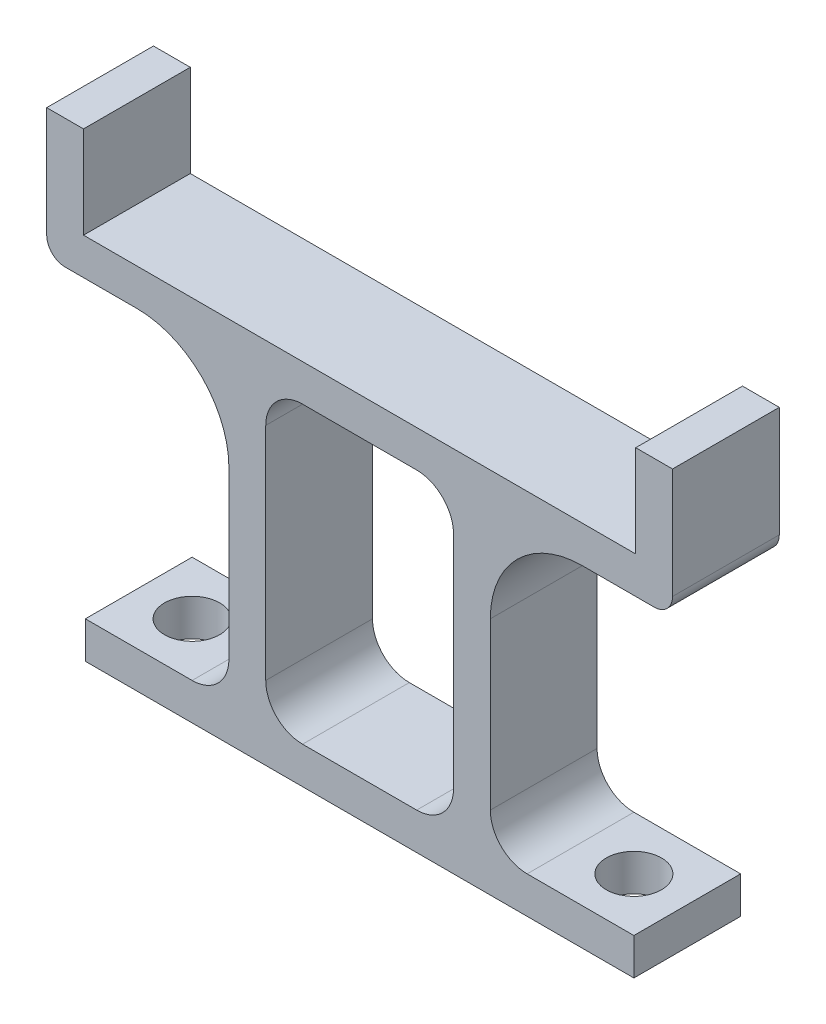
ISO-10303-21;
HEADER;
FILE_DESCRIPTION(('STEP AP214'),'2;1');
FILE_NAME('part.step','',(''),(''),'','','');
FILE_SCHEMA(('AUTOMOTIVE_DESIGN { 1 0 10303 214 1 1 1 1 }'));
ENDSEC;
DATA;
#1=APPLICATION_CONTEXT('core data for automotive mechanical design processes');
#2=APPLICATION_PROTOCOL_DEFINITION('international standard','automotive_design',2000,#1);
#3=PRODUCT_CONTEXT('',#1,'mechanical');
#4=PRODUCT('Part','Part','',(#3));
#5=PRODUCT_RELATED_PRODUCT_CATEGORY('part','',(#4));
#6=PRODUCT_DEFINITION_FORMATION('','',#4);
#7=PRODUCT_DEFINITION_CONTEXT('part definition',#1,'design');
#8=PRODUCT_DEFINITION('design','',#6,#7);
#9=PRODUCT_DEFINITION_SHAPE('','',#8);
#10=(LENGTH_UNIT() NAMED_UNIT(*) SI_UNIT(.MILLI.,.METRE.));
#11=(NAMED_UNIT(*) PLANE_ANGLE_UNIT() SI_UNIT($,.RADIAN.));
#12=(NAMED_UNIT(*) SI_UNIT($,.STERADIAN.) SOLID_ANGLE_UNIT());
#13=UNCERTAINTY_MEASURE_WITH_UNIT(LENGTH_MEASURE(1.E-05),#10,'distance_accuracy_value','');
#14=(GEOMETRIC_REPRESENTATION_CONTEXT(3) GLOBAL_UNCERTAINTY_ASSIGNED_CONTEXT((#13)) GLOBAL_UNIT_ASSIGNED_CONTEXT((#10,
#11,#12)) REPRESENTATION_CONTEXT('',''));
#15=CARTESIAN_POINT('',(0.,0.,0.));
#16=DIRECTION('',(0.,0.,1.));
#17=DIRECTION('',(1.,0.,0.));
#18=AXIS2_PLACEMENT_3D('',#15,#16,#17);
#19=CARTESIAN_POINT('',(-16.,19.,5.8));
#20=DIRECTION('',(0.,0.,-1.));
#21=DIRECTION('',(-1.,0.,0.));
#22=AXIS2_PLACEMENT_3D('',#19,#20,#21);
#23=PLANE('',#22);
#24=DIRECTION('',(-1.,0.,0.));
#25=VECTOR('',#24,1.);
#26=CARTESIAN_POINT('',(-15.,25.,5.8));
#27=LINE('',#26,#25);
#28=CARTESIAN_POINT('',(-15.,25.,5.8));
#29=VERTEX_POINT('',#28);
#30=CARTESIAN_POINT('',(-17.,25.,5.8));
#31=VERTEX_POINT('',#30);
#32=EDGE_CURVE('E242',#29,#31,#27,.T.);
#33=ORIENTED_EDGE('',*,*,#32,.T.);
#34=DIRECTION('',(0.,-1.,0.));
#35=VECTOR('',#34,1.);
#36=CARTESIAN_POINT('',(-17.,25.,5.8));
#37=LINE('',#36,#35);
#38=CARTESIAN_POINT('',(-17.,19.,5.8));
#39=VERTEX_POINT('',#38);
#40=EDGE_CURVE('E231',#31,#39,#37,.T.);
#41=ORIENTED_EDGE('',*,*,#40,.T.);
#42=CARTESIAN_POINT('',(-16.,19.,5.8));
#43=DIRECTION('',(0.,0.,1.));
#44=DIRECTION('',(-1.,0.,0.));
#45=AXIS2_PLACEMENT_3D('',#42,#43,#44);
#46=CIRCLE('',#45,1.);
#47=CARTESIAN_POINT('',(-16.,18.,5.8));
#48=VERTEX_POINT('',#47);
#49=EDGE_CURVE('E241',#39,#48,#46,.T.);
#50=ORIENTED_EDGE('',*,*,#49,.T.);
#51=DIRECTION('',(1.,0.,0.));
#52=VECTOR('',#51,1.);
#53=CARTESIAN_POINT('',(-16.,18.,5.8));
#54=LINE('',#53,#52);
#55=CARTESIAN_POINT('',(-12.1,18.,5.8));
#56=VERTEX_POINT('',#55);
#57=EDGE_CURVE('E327',#48,#56,#54,.T.);
#58=ORIENTED_EDGE('',*,*,#57,.T.);
#59=CARTESIAN_POINT('',(-12.1,13.,5.8));
#60=DIRECTION('',(0.,0.,-1.));
#61=DIRECTION('',(1.,0.,0.));
#62=AXIS2_PLACEMENT_3D('',#59,#60,#61);
#63=CIRCLE('',#62,5.);
#64=CARTESIAN_POINT('',(-7.1,13.,5.8));
#65=VERTEX_POINT('',#64);
#66=EDGE_CURVE('E329',#56,#65,#63,.T.);
#67=ORIENTED_EDGE('',*,*,#66,.T.);
#68=DIRECTION('',(0.,-1.,0.));
#69=VECTOR('',#68,1.);
#70=CARTESIAN_POINT('',(-7.1,13.,5.8));
#71=LINE('',#70,#69);
#72=CARTESIAN_POINT('',(-7.1,4.,5.8));
#73=VERTEX_POINT('',#72);
#74=EDGE_CURVE('E331',#65,#73,#71,.T.);
#75=ORIENTED_EDGE('',*,*,#74,.T.);
#76=CARTESIAN_POINT('',(-9.1,4.,5.8));
#77=DIRECTION('',(0.,0.,-1.));
#78=DIRECTION('',(-1.,0.,0.));
#79=AXIS2_PLACEMENT_3D('',#76,#77,#78);
#80=CIRCLE('',#79,2.);
#81=CARTESIAN_POINT('',(-9.1,2.,5.8));
#82=VERTEX_POINT('',#81);
#83=EDGE_CURVE('E333',#73,#82,#80,.T.);
#84=ORIENTED_EDGE('',*,*,#83,.T.);
#85=DIRECTION('',(-1.,0.,0.));
#86=VECTOR('',#85,1.);
#87=CARTESIAN_POINT('',(-9.1,2.,5.8));
#88=LINE('',#87,#86);
#89=CARTESIAN_POINT('',(-14.9,2.,5.8));
#90=VERTEX_POINT('',#89);
#91=EDGE_CURVE('E335',#82,#90,#88,.T.);
#92=ORIENTED_EDGE('',*,*,#91,.T.);
#93=DIRECTION('',(0.,-1.,0.));
#94=VECTOR('',#93,1.);
#95=CARTESIAN_POINT('',(-14.9,2.,5.8));
#96=LINE('',#95,#94);
#97=CARTESIAN_POINT('',(-14.9,0.,5.8));
#98=VERTEX_POINT('',#97);
#99=EDGE_CURVE('E337',#90,#98,#96,.T.);
#100=ORIENTED_EDGE('',*,*,#99,.T.);
#101=DIRECTION('',(1.,0.,0.));
#102=VECTOR('',#101,1.);
#103=CARTESIAN_POINT('',(-14.9,0.,5.8));
#104=LINE('',#103,#102);
#105=CARTESIAN_POINT('',(14.9,0.,5.8));
#106=VERTEX_POINT('',#105);
#107=EDGE_CURVE('E339',#98,#106,#104,.T.);
#108=ORIENTED_EDGE('',*,*,#107,.T.);
#109=DIRECTION('',(0.,1.,0.));
#110=VECTOR('',#109,1.);
#111=CARTESIAN_POINT('',(14.9,0.,5.8));
#112=LINE('',#111,#110);
#113=CARTESIAN_POINT('',(14.9,2.00000000000001,5.8));
#114=VERTEX_POINT('',#113);
#115=EDGE_CURVE('E341',#106,#114,#112,.T.);
#116=ORIENTED_EDGE('',*,*,#115,.T.);
#117=DIRECTION('',(-1.,0.,0.));
#118=VECTOR('',#117,1.);
#119=CARTESIAN_POINT('',(14.9,2.00000000000001,5.8));
#120=LINE('',#119,#118);
#121=CARTESIAN_POINT('',(9.1,2.,5.8));
#122=VERTEX_POINT('',#121);
#123=EDGE_CURVE('E343',#114,#122,#120,.T.);
#124=ORIENTED_EDGE('',*,*,#123,.T.);
#125=CARTESIAN_POINT('',(9.1,4.,5.8));
#126=DIRECTION('',(0.,0.,-1.));
#127=DIRECTION('',(1.,0.,0.));
#128=AXIS2_PLACEMENT_3D('',#125,#126,#127);
#129=CIRCLE('',#128,2.);
#130=CARTESIAN_POINT('',(7.1,4.,5.8));
#131=VERTEX_POINT('',#130);
#132=EDGE_CURVE('E345',#122,#131,#129,.T.);
#133=ORIENTED_EDGE('',*,*,#132,.T.);
#134=DIRECTION('',(0.,1.,0.));
#135=VECTOR('',#134,1.);
#136=CARTESIAN_POINT('',(7.1,4.,5.8));
#137=LINE('',#136,#135);
#138=CARTESIAN_POINT('',(7.1,13.,5.8));
#139=VERTEX_POINT('',#138);
#140=EDGE_CURVE('E347',#131,#139,#137,.T.);
#141=ORIENTED_EDGE('',*,*,#140,.T.);
#142=CARTESIAN_POINT('',(12.1,13.,5.8));
#143=DIRECTION('',(0.,0.,-1.));
#144=DIRECTION('',(-1.,0.,0.));
#145=AXIS2_PLACEMENT_3D('',#142,#143,#144);
#146=CIRCLE('',#145,5.);
#147=CARTESIAN_POINT('',(12.1,18.,5.8));
#148=VERTEX_POINT('',#147);
#149=EDGE_CURVE('E349',#139,#148,#146,.T.);
#150=ORIENTED_EDGE('',*,*,#149,.T.);
#151=DIRECTION('',(1.,0.,0.));
#152=VECTOR('',#151,1.);
#153=CARTESIAN_POINT('',(16.,18.,5.8));
#154=LINE('',#153,#152);
#155=CARTESIAN_POINT('',(16.,18.,5.8));
#156=VERTEX_POINT('',#155);
#157=EDGE_CURVE('E351',#148,#156,#154,.T.);
#158=ORIENTED_EDGE('',*,*,#157,.T.);
#159=CARTESIAN_POINT('',(16.,19.,5.8));
#160=DIRECTION('',(0.,0.,1.));
#161=DIRECTION('',(-1.,0.,0.));
#162=AXIS2_PLACEMENT_3D('',#159,#160,#161);
#163=CIRCLE('',#162,1.);
#164=CARTESIAN_POINT('',(17.,19.,5.8));
#165=VERTEX_POINT('',#164);
#166=EDGE_CURVE('E353',#156,#165,#163,.T.);
#167=ORIENTED_EDGE('',*,*,#166,.T.);
#168=DIRECTION('',(0.,1.,0.));
#169=VECTOR('',#168,1.);
#170=CARTESIAN_POINT('',(17.,25.,5.8));
#171=LINE('',#170,#169);
#172=CARTESIAN_POINT('',(17.,25.,5.8));
#173=VERTEX_POINT('',#172);
#174=EDGE_CURVE('E355',#165,#173,#171,.T.);
#175=ORIENTED_EDGE('',*,*,#174,.T.);
#176=DIRECTION('',(-1.,0.,0.));
#177=VECTOR('',#176,1.);
#178=CARTESIAN_POINT('',(15.,25.,5.8));
#179=LINE('',#178,#177);
#180=CARTESIAN_POINT('',(15.,25.,5.8));
#181=VERTEX_POINT('',#180);
#182=EDGE_CURVE('E357',#173,#181,#179,.T.);
#183=ORIENTED_EDGE('',*,*,#182,.T.);
#184=DIRECTION('',(0.,-1.,0.));
#185=VECTOR('',#184,1.);
#186=CARTESIAN_POINT('',(15.,20.,5.8));
#187=LINE('',#186,#185);
#188=CARTESIAN_POINT('',(15.,20.,5.8));
#189=VERTEX_POINT('',#188);
#190=EDGE_CURVE('E359',#181,#189,#187,.T.);
#191=ORIENTED_EDGE('',*,*,#190,.T.);
#192=DIRECTION('',(-1.,0.,0.));
#193=VECTOR('',#192,1.);
#194=CARTESIAN_POINT('',(-15.,20.,5.8));
#195=LINE('',#194,#193);
#196=CARTESIAN_POINT('',(-15.,20.,5.8));
#197=VERTEX_POINT('',#196);
#198=EDGE_CURVE('E361',#189,#197,#195,.T.);
#199=ORIENTED_EDGE('',*,*,#198,.T.);
#200=DIRECTION('',(0.,1.,0.));
#201=VECTOR('',#200,1.);
#202=CARTESIAN_POINT('',(-15.,25.,5.8));
#203=LINE('',#202,#201);
#204=EDGE_CURVE('E246',#197,#29,#203,.T.);
#205=ORIENTED_EDGE('',*,*,#204,.T.);
#206=EDGE_LOOP('',(#33,#41,#50,#58,#67,#75,#84,#92,#100,#108,#116,#124,#133,#141,#150,#158,#167,
#175,#183,#191,#199,#205));
#207=FACE_BOUND('',#206,.T.);
#208=DIRECTION('',(0.,-1.,0.));
#209=VECTOR('',#208,1.);
#210=CARTESIAN_POINT('',(-5.1,18.,5.8));
#211=LINE('',#210,#209);
#212=CARTESIAN_POINT('',(-5.1,16.,5.8));
#213=VERTEX_POINT('',#212);
#214=CARTESIAN_POINT('',(-5.1,4.,5.8));
#215=VERTEX_POINT('',#214);
#216=EDGE_CURVE('E324',#213,#215,#211,.T.);
#217=ORIENTED_EDGE('',*,*,#216,.F.);
#218=CARTESIAN_POINT('',(-3.1,16.,5.8));
#219=DIRECTION('',(0.,0.,-1.));
#220=DIRECTION('',(-1.,0.,0.));
#221=AXIS2_PLACEMENT_3D('',#218,#219,#220);
#222=CIRCLE('',#221,2.);
#223=CARTESIAN_POINT('',(-3.1,18.,5.8));
#224=VERTEX_POINT('',#223);
#225=EDGE_CURVE('E11',#213,#224,#222,.T.);
#226=ORIENTED_EDGE('',*,*,#225,.T.);
#227=DIRECTION('',(-1.,0.,0.));
#228=VECTOR('',#227,1.);
#229=CARTESIAN_POINT('',(-5.1,18.,5.8));
#230=LINE('',#229,#228);
#231=CARTESIAN_POINT('',(3.1,18.,5.8));
#232=VERTEX_POINT('',#231);
#233=EDGE_CURVE('E309',#232,#224,#230,.T.);
#234=ORIENTED_EDGE('',*,*,#233,.F.);
#235=CARTESIAN_POINT('',(3.1,16.,5.8));
#236=DIRECTION('',(0.,0.,-1.));
#237=DIRECTION('',(-1.,0.,0.));
#238=AXIS2_PLACEMENT_3D('',#235,#236,#237);
#239=CIRCLE('',#238,2.);
#240=CARTESIAN_POINT('',(5.1,16.,5.8));
#241=VERTEX_POINT('',#240);
#242=EDGE_CURVE('E289',#232,#241,#239,.T.);
#243=ORIENTED_EDGE('',*,*,#242,.T.);
#244=DIRECTION('',(0.,1.,0.));
#245=VECTOR('',#244,1.);
#246=CARTESIAN_POINT('',(5.1,18.,5.8));
#247=LINE('',#246,#245);
#248=CARTESIAN_POINT('',(5.1,4.,5.8));
#249=VERTEX_POINT('',#248);
#250=EDGE_CURVE('E311',#249,#241,#247,.T.);
#251=ORIENTED_EDGE('',*,*,#250,.F.);
#252=CARTESIAN_POINT('',(3.1,4.,5.8));
#253=DIRECTION('',(0.,0.,-1.));
#254=DIRECTION('',(-1.,0.,0.));
#255=AXIS2_PLACEMENT_3D('',#252,#253,#254);
#256=CIRCLE('',#255,2.);
#257=CARTESIAN_POINT('',(3.1,2.,5.8));
#258=VERTEX_POINT('',#257);
#259=EDGE_CURVE('E281',#249,#258,#256,.T.);
#260=ORIENTED_EDGE('',*,*,#259,.T.);
#261=DIRECTION('',(1.,0.,0.));
#262=VECTOR('',#261,1.);
#263=CARTESIAN_POINT('',(-5.1,2.,5.8));
#264=LINE('',#263,#262);
#265=CARTESIAN_POINT('',(-3.1,2.,5.8));
#266=VERTEX_POINT('',#265);
#267=EDGE_CURVE('E316',#266,#258,#264,.T.);
#268=ORIENTED_EDGE('',*,*,#267,.F.);
#269=CARTESIAN_POINT('',(-3.1,4.,5.8));
#270=DIRECTION('',(0.,0.,-1.));
#271=DIRECTION('',(-1.,0.,0.));
#272=AXIS2_PLACEMENT_3D('',#269,#270,#271);
#273=CIRCLE('',#272,2.);
#274=EDGE_CURVE('E285',#266,#215,#273,.T.);
#275=ORIENTED_EDGE('',*,*,#274,.T.);
#276=EDGE_LOOP('',(#217,#226,#234,#243,#251,#260,#268,#275));
#277=FACE_BOUND('',#276,.T.);
#278=ADVANCED_FACE('F34',(#207,#277),#23,.F.);
#279=CARTESIAN_POINT('',(-16.,19.,0.));
#280=DIRECTION('',(0.,0.,-1.));
#281=DIRECTION('',(-1.,0.,0.));
#282=AXIS2_PLACEMENT_3D('',#279,#280,#281);
#283=PLANE('',#282);
#284=DIRECTION('',(-1.,0.,0.));
#285=VECTOR('',#284,1.);
#286=CARTESIAN_POINT('',(-15.,25.,0.));
#287=LINE('',#286,#285);
#288=CARTESIAN_POINT('',(-15.,25.,0.));
#289=VERTEX_POINT('',#288);
#290=CARTESIAN_POINT('',(-17.,25.,0.));
#291=VERTEX_POINT('',#290);
#292=EDGE_CURVE('E254',#289,#291,#287,.T.);
#293=ORIENTED_EDGE('',*,*,#292,.F.);
#294=DIRECTION('',(0.,1.,0.));
#295=VECTOR('',#294,1.);
#296=CARTESIAN_POINT('',(-15.,25.,0.));
#297=LINE('',#296,#295);
#298=CARTESIAN_POINT('',(-15.,20.,0.));
#299=VERTEX_POINT('',#298);
#300=EDGE_CURVE('E250',#299,#289,#297,.T.);
#301=ORIENTED_EDGE('',*,*,#300,.F.);
#302=DIRECTION('',(-1.,0.,0.));
#303=VECTOR('',#302,1.);
#304=CARTESIAN_POINT('',(-15.,20.,0.));
#305=LINE('',#304,#303);
#306=CARTESIAN_POINT('',(15.,20.,0.));
#307=VERTEX_POINT('',#306);
#308=EDGE_CURVE('E402',#307,#299,#305,.T.);
#309=ORIENTED_EDGE('',*,*,#308,.F.);
#310=DIRECTION('',(0.,-1.,0.));
#311=VECTOR('',#310,1.);
#312=CARTESIAN_POINT('',(15.,20.,0.));
#313=LINE('',#312,#311);
#314=CARTESIAN_POINT('',(15.,25.,0.));
#315=VERTEX_POINT('',#314);
#316=EDGE_CURVE('E400',#315,#307,#313,.T.);
#317=ORIENTED_EDGE('',*,*,#316,.F.);
#318=DIRECTION('',(-1.,0.,0.));
#319=VECTOR('',#318,1.);
#320=CARTESIAN_POINT('',(15.,25.,0.));
#321=LINE('',#320,#319);
#322=CARTESIAN_POINT('',(17.,25.,0.));
#323=VERTEX_POINT('',#322);
#324=EDGE_CURVE('E398',#323,#315,#321,.T.);
#325=ORIENTED_EDGE('',*,*,#324,.F.);
#326=DIRECTION('',(0.,1.,0.));
#327=VECTOR('',#326,1.);
#328=CARTESIAN_POINT('',(17.,25.,0.));
#329=LINE('',#328,#327);
#330=CARTESIAN_POINT('',(17.,19.,0.));
#331=VERTEX_POINT('',#330);
#332=EDGE_CURVE('E396',#331,#323,#329,.T.);
#333=ORIENTED_EDGE('',*,*,#332,.F.);
#334=CARTESIAN_POINT('',(16.,19.,0.));
#335=DIRECTION('',(0.,0.,1.));
#336=DIRECTION('',(-1.,0.,0.));
#337=AXIS2_PLACEMENT_3D('',#334,#335,#336);
#338=CIRCLE('',#337,1.);
#339=CARTESIAN_POINT('',(16.,18.,0.));
#340=VERTEX_POINT('',#339);
#341=EDGE_CURVE('E394',#340,#331,#338,.T.);
#342=ORIENTED_EDGE('',*,*,#341,.F.);
#343=DIRECTION('',(1.,0.,0.));
#344=VECTOR('',#343,1.);
#345=CARTESIAN_POINT('',(16.,18.,0.));
#346=LINE('',#345,#344);
#347=CARTESIAN_POINT('',(12.1,18.,0.));
#348=VERTEX_POINT('',#347);
#349=EDGE_CURVE('E392',#348,#340,#346,.T.);
#350=ORIENTED_EDGE('',*,*,#349,.F.);
#351=CARTESIAN_POINT('',(12.1,13.,0.));
#352=DIRECTION('',(0.,0.,-1.));
#353=DIRECTION('',(-1.,0.,0.));
#354=AXIS2_PLACEMENT_3D('',#351,#352,#353);
#355=CIRCLE('',#354,5.);
#356=CARTESIAN_POINT('',(7.1,13.,0.));
#357=VERTEX_POINT('',#356);
#358=EDGE_CURVE('E390',#357,#348,#355,.T.);
#359=ORIENTED_EDGE('',*,*,#358,.F.);
#360=DIRECTION('',(0.,1.,0.));
#361=VECTOR('',#360,1.);
#362=CARTESIAN_POINT('',(7.1,4.,0.));
#363=LINE('',#362,#361);
#364=CARTESIAN_POINT('',(7.1,4.,0.));
#365=VERTEX_POINT('',#364);
#366=EDGE_CURVE('E388',#365,#357,#363,.T.);
#367=ORIENTED_EDGE('',*,*,#366,.F.);
#368=CARTESIAN_POINT('',(9.1,4.,0.));
#369=DIRECTION('',(0.,0.,-1.));
#370=DIRECTION('',(1.,0.,0.));
#371=AXIS2_PLACEMENT_3D('',#368,#369,#370);
#372=CIRCLE('',#371,2.);
#373=CARTESIAN_POINT('',(9.1,2.,0.));
#374=VERTEX_POINT('',#373);
#375=EDGE_CURVE('E386',#374,#365,#372,.T.);
#376=ORIENTED_EDGE('',*,*,#375,.F.);
#377=DIRECTION('',(-1.,0.,0.));
#378=VECTOR('',#377,1.);
#379=CARTESIAN_POINT('',(14.9,2.00000000000001,0.));
#380=LINE('',#379,#378);
#381=CARTESIAN_POINT('',(14.9,2.00000000000001,0.));
#382=VERTEX_POINT('',#381);
#383=EDGE_CURVE('E384',#382,#374,#380,.T.);
#384=ORIENTED_EDGE('',*,*,#383,.F.);
#385=DIRECTION('',(0.,1.,0.));
#386=VECTOR('',#385,1.);
#387=CARTESIAN_POINT('',(14.9,0.,0.));
#388=LINE('',#387,#386);
#389=CARTESIAN_POINT('',(14.9,0.,0.));
#390=VERTEX_POINT('',#389);
#391=EDGE_CURVE('E382',#390,#382,#388,.T.);
#392=ORIENTED_EDGE('',*,*,#391,.F.);
#393=DIRECTION('',(1.,0.,0.));
#394=VECTOR('',#393,1.);
#395=CARTESIAN_POINT('',(-14.9,0.,0.));
#396=LINE('',#395,#394);
#397=CARTESIAN_POINT('',(-14.9,0.,0.));
#398=VERTEX_POINT('',#397);
#399=EDGE_CURVE('E380',#398,#390,#396,.T.);
#400=ORIENTED_EDGE('',*,*,#399,.F.);
#401=DIRECTION('',(0.,-1.,0.));
#402=VECTOR('',#401,1.);
#403=CARTESIAN_POINT('',(-14.9,2.,0.));
#404=LINE('',#403,#402);
#405=CARTESIAN_POINT('',(-14.9,2.,0.));
#406=VERTEX_POINT('',#405);
#407=EDGE_CURVE('E378',#406,#398,#404,.T.);
#408=ORIENTED_EDGE('',*,*,#407,.F.);
#409=DIRECTION('',(-1.,0.,0.));
#410=VECTOR('',#409,1.);
#411=CARTESIAN_POINT('',(-9.1,2.,0.));
#412=LINE('',#411,#410);
#413=CARTESIAN_POINT('',(-9.1,2.,0.));
#414=VERTEX_POINT('',#413);
#415=EDGE_CURVE('E376',#414,#406,#412,.T.);
#416=ORIENTED_EDGE('',*,*,#415,.F.);
#417=CARTESIAN_POINT('',(-9.1,4.,0.));
#418=DIRECTION('',(0.,0.,-1.));
#419=DIRECTION('',(-1.,0.,0.));
#420=AXIS2_PLACEMENT_3D('',#417,#418,#419);
#421=CIRCLE('',#420,2.);
#422=CARTESIAN_POINT('',(-7.1,4.,0.));
#423=VERTEX_POINT('',#422);
#424=EDGE_CURVE('E374',#423,#414,#421,.T.);
#425=ORIENTED_EDGE('',*,*,#424,.F.);
#426=DIRECTION('',(0.,-1.,0.));
#427=VECTOR('',#426,1.);
#428=CARTESIAN_POINT('',(-7.1,13.,0.));
#429=LINE('',#428,#427);
#430=CARTESIAN_POINT('',(-7.1,13.,0.));
#431=VERTEX_POINT('',#430);
#432=EDGE_CURVE('E372',#431,#423,#429,.T.);
#433=ORIENTED_EDGE('',*,*,#432,.F.);
#434=CARTESIAN_POINT('',(-12.1,13.,0.));
#435=DIRECTION('',(0.,0.,-1.));
#436=DIRECTION('',(1.,0.,0.));
#437=AXIS2_PLACEMENT_3D('',#434,#435,#436);
#438=CIRCLE('',#437,5.);
#439=CARTESIAN_POINT('',(-12.1,18.,0.));
#440=VERTEX_POINT('',#439);
#441=EDGE_CURVE('E370',#440,#431,#438,.T.);
#442=ORIENTED_EDGE('',*,*,#441,.F.);
#443=DIRECTION('',(1.,0.,0.));
#444=VECTOR('',#443,1.);
#445=CARTESIAN_POINT('',(-16.,18.,0.));
#446=LINE('',#445,#444);
#447=CARTESIAN_POINT('',(-16.,18.,0.));
#448=VERTEX_POINT('',#447);
#449=EDGE_CURVE('E368',#448,#440,#446,.T.);
#450=ORIENTED_EDGE('',*,*,#449,.F.);
#451=CARTESIAN_POINT('',(-16.,19.,0.));
#452=DIRECTION('',(0.,0.,1.));
#453=DIRECTION('',(-1.,0.,0.));
#454=AXIS2_PLACEMENT_3D('',#451,#452,#453);
#455=CIRCLE('',#454,1.);
#456=CARTESIAN_POINT('',(-17.,19.,0.));
#457=VERTEX_POINT('',#456);
#458=EDGE_CURVE('E366',#457,#448,#455,.T.);
#459=ORIENTED_EDGE('',*,*,#458,.F.);
#460=DIRECTION('',(0.,-1.,0.));
#461=VECTOR('',#460,1.);
#462=CARTESIAN_POINT('',(-17.,25.,0.));
#463=LINE('',#462,#461);
#464=EDGE_CURVE('E313',#291,#457,#463,.T.);
#465=ORIENTED_EDGE('',*,*,#464,.F.);
#466=EDGE_LOOP('',(#293,#301,#309,#317,#325,#333,#342,#350,#359,#367,#376,#384,#392,#400,#408,
#416,#425,#433,#442,#450,#459,#465));
#467=FACE_BOUND('',#466,.T.);
#468=DIRECTION('',(0.,1.,0.));
#469=VECTOR('',#468,1.);
#470=CARTESIAN_POINT('',(5.1,18.,0.));
#471=LINE('',#470,#469);
#472=CARTESIAN_POINT('',(5.1,4.,0.));
#473=VERTEX_POINT('',#472);
#474=CARTESIAN_POINT('',(5.1,16.,0.));
#475=VERTEX_POINT('',#474);
#476=EDGE_CURVE('E322',#473,#475,#471,.T.);
#477=ORIENTED_EDGE('',*,*,#476,.T.);
#478=CARTESIAN_POINT('',(3.1,16.,0.));
#479=DIRECTION('',(0.,0.,-1.));
#480=DIRECTION('',(-1.,0.,0.));
#481=AXIS2_PLACEMENT_3D('',#478,#479,#480);
#482=CIRCLE('',#481,2.);
#483=CARTESIAN_POINT('',(3.1,18.,0.));
#484=VERTEX_POINT('',#483);
#485=EDGE_CURVE('E287',#475,#484,#482,.F.);
#486=ORIENTED_EDGE('',*,*,#485,.T.);
#487=DIRECTION('',(-1.,0.,0.));
#488=VECTOR('',#487,1.);
#489=CARTESIAN_POINT('',(-5.1,18.,0.));
#490=LINE('',#489,#488);
#491=CARTESIAN_POINT('',(-3.1,18.,0.));
#492=VERTEX_POINT('',#491);
#493=EDGE_CURVE('E297',#484,#492,#490,.T.);
#494=ORIENTED_EDGE('',*,*,#493,.T.);
#495=CARTESIAN_POINT('',(-3.1,16.,0.));
#496=DIRECTION('',(0.,0.,-1.));
#497=DIRECTION('',(-1.,0.,0.));
#498=AXIS2_PLACEMENT_3D('',#495,#496,#497);
#499=CIRCLE('',#498,2.);
#500=CARTESIAN_POINT('',(-5.1,16.,0.));
#501=VERTEX_POINT('',#500);
#502=EDGE_CURVE('E42',#492,#501,#499,.F.);
#503=ORIENTED_EDGE('',*,*,#502,.T.);
#504=DIRECTION('',(0.,-1.,0.));
#505=VECTOR('',#504,1.);
#506=CARTESIAN_POINT('',(-5.1,18.,0.));
#507=LINE('',#506,#505);
#508=CARTESIAN_POINT('',(-5.1,4.,0.));
#509=VERTEX_POINT('',#508);
#510=EDGE_CURVE('E296',#501,#509,#507,.T.);
#511=ORIENTED_EDGE('',*,*,#510,.T.);
#512=CARTESIAN_POINT('',(-3.1,4.,0.));
#513=DIRECTION('',(0.,0.,-1.));
#514=DIRECTION('',(-1.,0.,0.));
#515=AXIS2_PLACEMENT_3D('',#512,#513,#514);
#516=CIRCLE('',#515,2.);
#517=CARTESIAN_POINT('',(-3.1,2.,0.));
#518=VERTEX_POINT('',#517);
#519=EDGE_CURVE('E283',#509,#518,#516,.F.);
#520=ORIENTED_EDGE('',*,*,#519,.T.);
#521=DIRECTION('',(1.,0.,0.));
#522=VECTOR('',#521,1.);
#523=CARTESIAN_POINT('',(-5.1,2.,0.));
#524=LINE('',#523,#522);
#525=CARTESIAN_POINT('',(3.1,2.,0.));
#526=VERTEX_POINT('',#525);
#527=EDGE_CURVE('E305',#518,#526,#524,.T.);
#528=ORIENTED_EDGE('',*,*,#527,.T.);
#529=CARTESIAN_POINT('',(3.1,4.,0.));
#530=DIRECTION('',(0.,0.,-1.));
#531=DIRECTION('',(-1.,0.,0.));
#532=AXIS2_PLACEMENT_3D('',#529,#530,#531);
#533=CIRCLE('',#532,2.);
#534=EDGE_CURVE('E279',#526,#473,#533,.F.);
#535=ORIENTED_EDGE('',*,*,#534,.T.);
#536=EDGE_LOOP('',(#477,#486,#494,#503,#511,#520,#528,#535));
#537=FACE_BOUND('',#536,.T.);
#538=ADVANCED_FACE('F295',(#467,#537),#283,.T.);
#539=CARTESIAN_POINT('',(-15.,25.,5.8));
#540=DIRECTION('',(0.,-1.,0.));
#541=DIRECTION('',(0.,0.,-1.));
#542=AXIS2_PLACEMENT_3D('',#539,#540,#541);
#543=PLANE('',#542);
#544=ORIENTED_EDGE('',*,*,#292,.T.);
#545=DIRECTION('',(0.,0.,-1.));
#546=VECTOR('',#545,1.);
#547=CARTESIAN_POINT('',(-17.,25.,5.8));
#548=LINE('',#547,#546);
#549=EDGE_CURVE('E235',#31,#291,#548,.T.);
#550=ORIENTED_EDGE('',*,*,#549,.F.);
#551=ORIENTED_EDGE('',*,*,#32,.F.);
#552=DIRECTION('',(0.,0.,-1.));
#553=VECTOR('',#552,1.);
#554=CARTESIAN_POINT('',(-15.,25.,5.8));
#555=LINE('',#554,#553);
#556=EDGE_CURVE('E363',#29,#289,#555,.T.);
#557=ORIENTED_EDGE('',*,*,#556,.T.);
#558=EDGE_LOOP('',(#544,#550,#551,#557));
#559=FACE_BOUND('',#558,.T.);
#560=ADVANCED_FACE('F252',(#559),#543,.F.);
#561=CARTESIAN_POINT('',(-17.,25.,5.8));
#562=DIRECTION('',(1.,0.,0.));
#563=DIRECTION('',(0.,1.,0.));
#564=AXIS2_PLACEMENT_3D('',#561,#562,#563);
#565=PLANE('',#564);
#566=ORIENTED_EDGE('',*,*,#464,.T.);
#567=DIRECTION('',(0.,0.,-1.));
#568=VECTOR('',#567,1.);
#569=CARTESIAN_POINT('',(-17.,19.,5.8));
#570=LINE('',#569,#568);
#571=EDGE_CURVE('E238',#39,#457,#570,.T.);
#572=ORIENTED_EDGE('',*,*,#571,.F.);
#573=ORIENTED_EDGE('',*,*,#40,.F.);
#574=ORIENTED_EDGE('',*,*,#549,.T.);
#575=EDGE_LOOP('',(#566,#572,#573,#574));
#576=FACE_BOUND('',#575,.T.);
#577=ADVANCED_FACE('F233',(#576),#565,.F.);
#578=CARTESIAN_POINT('',(-16.,19.,5.8));
#579=DIRECTION('',(0.,0.,-1.));
#580=DIRECTION('',(-1.,0.,0.));
#581=AXIS2_PLACEMENT_3D('',#578,#579,#580);
#582=CYLINDRICAL_SURFACE('',#581,1.);
#583=ORIENTED_EDGE('',*,*,#458,.T.);
#584=DIRECTION('',(0.,0.,-1.));
#585=VECTOR('',#584,1.);
#586=CARTESIAN_POINT('',(-16.,18.,5.8));
#587=LINE('',#586,#585);
#588=EDGE_CURVE('E259',#48,#448,#587,.T.);
#589=ORIENTED_EDGE('',*,*,#588,.F.);
#590=ORIENTED_EDGE('',*,*,#49,.F.);
#591=ORIENTED_EDGE('',*,*,#571,.T.);
#592=EDGE_LOOP('',(#583,#589,#590,#591));
#593=FACE_BOUND('',#592,.T.);
#594=ADVANCED_FACE('F482',(#593),#582,.T.);
#595=CARTESIAN_POINT('',(-16.,18.,5.8));
#596=DIRECTION('',(0.,1.,0.));
#597=DIRECTION('',(-1.,0.,0.));
#598=AXIS2_PLACEMENT_3D('',#595,#596,#597);
#599=PLANE('',#598);
#600=ORIENTED_EDGE('',*,*,#449,.T.);
#601=DIRECTION('',(0.,0.,-1.));
#602=VECTOR('',#601,1.);
#603=CARTESIAN_POINT('',(-12.1,18.,5.8));
#604=LINE('',#603,#602);
#605=EDGE_CURVE('E457',#56,#440,#604,.T.);
#606=ORIENTED_EDGE('',*,*,#605,.F.);
#607=ORIENTED_EDGE('',*,*,#57,.F.);
#608=ORIENTED_EDGE('',*,*,#588,.T.);
#609=EDGE_LOOP('',(#600,#606,#607,#608));
#610=FACE_BOUND('',#609,.T.);
#611=ADVANCED_FACE('F464',(#610),#599,.F.);
#612=CARTESIAN_POINT('',(-12.1,13.,5.8));
#613=DIRECTION('',(0.,0.,-1.));
#614=DIRECTION('',(-1.,0.,0.));
#615=AXIS2_PLACEMENT_3D('',#612,#613,#614);
#616=CYLINDRICAL_SURFACE('',#615,5.);
#617=ORIENTED_EDGE('',*,*,#441,.T.);
#618=DIRECTION('',(0.,0.,-1.));
#619=VECTOR('',#618,1.);
#620=CARTESIAN_POINT('',(-7.1,13.,5.8));
#621=LINE('',#620,#619);
#622=EDGE_CURVE('E454',#65,#431,#621,.T.);
#623=ORIENTED_EDGE('',*,*,#622,.F.);
#624=ORIENTED_EDGE('',*,*,#66,.F.);
#625=ORIENTED_EDGE('',*,*,#605,.T.);
#626=EDGE_LOOP('',(#617,#623,#624,#625));
#627=FACE_BOUND('',#626,.T.);
#628=ADVANCED_FACE('F474',(#627),#616,.F.);
#629=CARTESIAN_POINT('',(-7.1,13.,5.8));
#630=DIRECTION('',(1.,0.,0.));
#631=DIRECTION('',(0.,1.,0.));
#632=AXIS2_PLACEMENT_3D('',#629,#630,#631);
#633=PLANE('',#632);
#634=ORIENTED_EDGE('',*,*,#432,.T.);
#635=DIRECTION('',(0.,0.,-1.));
#636=VECTOR('',#635,1.);
#637=CARTESIAN_POINT('',(-7.1,4.,5.8));
#638=LINE('',#637,#636);
#639=EDGE_CURVE('E451',#73,#423,#638,.T.);
#640=ORIENTED_EDGE('',*,*,#639,.F.);
#641=ORIENTED_EDGE('',*,*,#74,.F.);
#642=ORIENTED_EDGE('',*,*,#622,.T.);
#643=EDGE_LOOP('',(#634,#640,#641,#642));
#644=FACE_BOUND('',#643,.T.);
#645=ADVANCED_FACE('F478',(#644),#633,.F.);
#646=CARTESIAN_POINT('',(-9.1,4.,5.8));
#647=DIRECTION('',(0.,0.,-1.));
#648=DIRECTION('',(-1.,0.,0.));
#649=AXIS2_PLACEMENT_3D('',#646,#647,#648);
#650=CYLINDRICAL_SURFACE('',#649,2.);
#651=ORIENTED_EDGE('',*,*,#424,.T.);
#652=DIRECTION('',(0.,0.,-1.));
#653=VECTOR('',#652,1.);
#654=CARTESIAN_POINT('',(-9.1,2.,5.8));
#655=LINE('',#654,#653);
#656=EDGE_CURVE('E448',#82,#414,#655,.T.);
#657=ORIENTED_EDGE('',*,*,#656,.F.);
#658=ORIENTED_EDGE('',*,*,#83,.F.);
#659=ORIENTED_EDGE('',*,*,#639,.T.);
#660=EDGE_LOOP('',(#651,#657,#658,#659));
#661=FACE_BOUND('',#660,.T.);
#662=ADVANCED_FACE('F559',(#661),#650,.F.);
#663=CARTESIAN_POINT('',(-9.1,2.,5.8));
#664=DIRECTION('',(0.,-1.,0.));
#665=DIRECTION('',(1.,0.,0.));
#666=AXIS2_PLACEMENT_3D('',#663,#664,#665);
#667=PLANE('',#666);
#668=CARTESIAN_POINT('',(-12.,2.,2.9));
#669=DIRECTION('',(0.,1.,0.));
#670=DIRECTION('',(-1.,0.,0.));
#671=AXIS2_PLACEMENT_3D('',#668,#669,#670);
#672=CIRCLE('',#671,1.5);
#673=CARTESIAN_POINT('',(-13.5,2.,2.9));
#674=VERTEX_POINT('',#673);
#675=EDGE_CURVE('E818',#674,#674,#672,.T.);
#676=ORIENTED_EDGE('',*,*,#675,.F.);
#677=EDGE_LOOP('',(#676));
#678=FACE_BOUND('',#677,.T.);
#679=ORIENTED_EDGE('',*,*,#415,.T.);
#680=DIRECTION('',(0.,0.,-1.));
#681=VECTOR('',#680,1.);
#682=CARTESIAN_POINT('',(-14.9,2.,5.8));
#683=LINE('',#682,#681);
#684=EDGE_CURVE('E445',#90,#406,#683,.T.);
#685=ORIENTED_EDGE('',*,*,#684,.F.);
#686=ORIENTED_EDGE('',*,*,#91,.F.);
#687=ORIENTED_EDGE('',*,*,#656,.T.);
#688=EDGE_LOOP('',(#679,#685,#686,#687));
#689=FACE_BOUND('',#688,.T.);
#690=ADVANCED_FACE('F555',(#678,#689),#667,.F.);
#691=CARTESIAN_POINT('',(-14.9,2.,5.8));
#692=DIRECTION('',(1.,0.,0.));
#693=DIRECTION('',(0.,0.,-1.));
#694=AXIS2_PLACEMENT_3D('',#691,#692,#693);
#695=PLANE('',#694);
#696=ORIENTED_EDGE('',*,*,#407,.T.);
#697=DIRECTION('',(0.,0.,-1.));
#698=VECTOR('',#697,1.);
#699=CARTESIAN_POINT('',(-14.9,0.,5.8));
#700=LINE('',#699,#698);
#701=EDGE_CURVE('E442',#98,#398,#700,.T.);
#702=ORIENTED_EDGE('',*,*,#701,.F.);
#703=ORIENTED_EDGE('',*,*,#99,.F.);
#704=ORIENTED_EDGE('',*,*,#684,.T.);
#705=EDGE_LOOP('',(#696,#702,#703,#704));
#706=FACE_BOUND('',#705,.T.);
#707=ADVANCED_FACE('F551',(#706),#695,.F.);
#708=CARTESIAN_POINT('',(-14.9,0.,5.8));
#709=DIRECTION('',(0.,1.,0.));
#710=DIRECTION('',(-1.,0.,0.));
#711=AXIS2_PLACEMENT_3D('',#708,#709,#710);
#712=PLANE('',#711);
#713=CARTESIAN_POINT('',(-12.,0.,2.9));
#714=DIRECTION('',(0.,1.,0.));
#715=DIRECTION('',(-1.,0.,0.));
#716=AXIS2_PLACEMENT_3D('',#713,#714,#715);
#717=CIRCLE('',#716,1.5);
#718=CARTESIAN_POINT('',(-13.5,0.,2.9));
#719=VERTEX_POINT('',#718);
#720=EDGE_CURVE('E306',#719,#719,#717,.T.);
#721=ORIENTED_EDGE('',*,*,#720,.T.);
#722=EDGE_LOOP('',(#721));
#723=FACE_BOUND('',#722,.T.);
#724=CARTESIAN_POINT('',(12.,0.,2.9));
#725=DIRECTION('',(0.,1.,0.));
#726=DIRECTION('',(-1.,0.,0.));
#727=AXIS2_PLACEMENT_3D('',#724,#725,#726);
#728=CIRCLE('',#727,1.5);
#729=CARTESIAN_POINT('',(10.5,0.,2.9));
#730=VERTEX_POINT('',#729);
#731=EDGE_CURVE('E815',#730,#730,#728,.T.);
#732=ORIENTED_EDGE('',*,*,#731,.T.);
#733=EDGE_LOOP('',(#732));
#734=FACE_BOUND('',#733,.T.);
#735=ORIENTED_EDGE('',*,*,#399,.T.);
#736=DIRECTION('',(0.,0.,-1.));
#737=VECTOR('',#736,1.);
#738=CARTESIAN_POINT('',(14.9,0.,5.8));
#739=LINE('',#738,#737);
#740=EDGE_CURVE('E439',#106,#390,#739,.T.);
#741=ORIENTED_EDGE('',*,*,#740,.F.);
#742=ORIENTED_EDGE('',*,*,#107,.F.);
#743=ORIENTED_EDGE('',*,*,#701,.T.);
#744=EDGE_LOOP('',(#735,#741,#742,#743));
#745=FACE_BOUND('',#744,.T.);
#746=ADVANCED_FACE('F547',(#723,#734,#745),#712,.F.);
#747=CARTESIAN_POINT('',(14.9,0.,5.8));
#748=DIRECTION('',(-1.,0.,0.));
#749=DIRECTION('',(0.,0.,1.));
#750=AXIS2_PLACEMENT_3D('',#747,#748,#749);
#751=PLANE('',#750);
#752=ORIENTED_EDGE('',*,*,#391,.T.);
#753=DIRECTION('',(0.,0.,-1.));
#754=VECTOR('',#753,1.);
#755=CARTESIAN_POINT('',(14.9,2.00000000000001,5.8));
#756=LINE('',#755,#754);
#757=EDGE_CURVE('E436',#114,#382,#756,.T.);
#758=ORIENTED_EDGE('',*,*,#757,.F.);
#759=ORIENTED_EDGE('',*,*,#115,.F.);
#760=ORIENTED_EDGE('',*,*,#740,.T.);
#761=EDGE_LOOP('',(#752,#758,#759,#760));
#762=FACE_BOUND('',#761,.T.);
#763=ADVANCED_FACE('F543',(#762),#751,.F.);
#764=CARTESIAN_POINT('',(14.9,2.00000000000001,5.8));
#765=DIRECTION('',(0.,-1.,0.));
#766=DIRECTION('',(1.,0.,0.));
#767=AXIS2_PLACEMENT_3D('',#764,#765,#766);
#768=PLANE('',#767);
#769=CARTESIAN_POINT('',(12.,2.,2.9));
#770=DIRECTION('',(0.,1.,0.));
#771=DIRECTION('',(-1.,0.,0.));
#772=AXIS2_PLACEMENT_3D('',#769,#770,#771);
#773=CIRCLE('',#772,1.5);
#774=CARTESIAN_POINT('',(10.5,2.,2.9));
#775=VERTEX_POINT('',#774);
#776=EDGE_CURVE('E812',#775,#775,#773,.T.);
#777=ORIENTED_EDGE('',*,*,#776,.F.);
#778=EDGE_LOOP('',(#777));
#779=FACE_BOUND('',#778,.T.);
#780=ORIENTED_EDGE('',*,*,#383,.T.);
#781=DIRECTION('',(0.,0.,-1.));
#782=VECTOR('',#781,1.);
#783=CARTESIAN_POINT('',(9.1,2.,5.8));
#784=LINE('',#783,#782);
#785=EDGE_CURVE('E433',#122,#374,#784,.T.);
#786=ORIENTED_EDGE('',*,*,#785,.F.);
#787=ORIENTED_EDGE('',*,*,#123,.F.);
#788=ORIENTED_EDGE('',*,*,#757,.T.);
#789=EDGE_LOOP('',(#780,#786,#787,#788));
#790=FACE_BOUND('',#789,.T.);
#791=ADVANCED_FACE('F539',(#779,#790),#768,.F.);
#792=CARTESIAN_POINT('',(9.1,4.,5.8));
#793=DIRECTION('',(0.,0.,-1.));
#794=DIRECTION('',(-1.,0.,0.));
#795=AXIS2_PLACEMENT_3D('',#792,#793,#794);
#796=CYLINDRICAL_SURFACE('',#795,2.);
#797=ORIENTED_EDGE('',*,*,#375,.T.);
#798=DIRECTION('',(0.,0.,-1.));
#799=VECTOR('',#798,1.);
#800=CARTESIAN_POINT('',(7.1,4.,5.8));
#801=LINE('',#800,#799);
#802=EDGE_CURVE('E430',#131,#365,#801,.T.);
#803=ORIENTED_EDGE('',*,*,#802,.F.);
#804=ORIENTED_EDGE('',*,*,#132,.F.);
#805=ORIENTED_EDGE('',*,*,#785,.T.);
#806=EDGE_LOOP('',(#797,#803,#804,#805));
#807=FACE_BOUND('',#806,.T.);
#808=ADVANCED_FACE('F535',(#807),#796,.F.);
#809=CARTESIAN_POINT('',(7.1,4.,5.8));
#810=DIRECTION('',(-1.,0.,0.));
#811=DIRECTION('',(0.,-1.,0.));
#812=AXIS2_PLACEMENT_3D('',#809,#810,#811);
#813=PLANE('',#812);
#814=ORIENTED_EDGE('',*,*,#366,.T.);
#815=DIRECTION('',(0.,0.,-1.));
#816=VECTOR('',#815,1.);
#817=CARTESIAN_POINT('',(7.1,13.,5.8));
#818=LINE('',#817,#816);
#819=EDGE_CURVE('E427',#139,#357,#818,.T.);
#820=ORIENTED_EDGE('',*,*,#819,.F.);
#821=ORIENTED_EDGE('',*,*,#140,.F.);
#822=ORIENTED_EDGE('',*,*,#802,.T.);
#823=EDGE_LOOP('',(#814,#820,#821,#822));
#824=FACE_BOUND('',#823,.T.);
#825=ADVANCED_FACE('F531',(#824),#813,.F.);
#826=CARTESIAN_POINT('',(12.1,13.,5.8));
#827=DIRECTION('',(0.,0.,-1.));
#828=DIRECTION('',(-1.,0.,0.));
#829=AXIS2_PLACEMENT_3D('',#826,#827,#828);
#830=CYLINDRICAL_SURFACE('',#829,5.);
#831=ORIENTED_EDGE('',*,*,#358,.T.);
#832=DIRECTION('',(0.,0.,-1.));
#833=VECTOR('',#832,1.);
#834=CARTESIAN_POINT('',(12.1,18.,5.8));
#835=LINE('',#834,#833);
#836=EDGE_CURVE('E424',#148,#348,#835,.T.);
#837=ORIENTED_EDGE('',*,*,#836,.F.);
#838=ORIENTED_EDGE('',*,*,#149,.F.);
#839=ORIENTED_EDGE('',*,*,#819,.T.);
#840=EDGE_LOOP('',(#831,#837,#838,#839));
#841=FACE_BOUND('',#840,.T.);
#842=ADVANCED_FACE('F527',(#841),#830,.F.);
#843=CARTESIAN_POINT('',(16.,18.,5.8));
#844=DIRECTION('',(0.,1.,0.));
#845=DIRECTION('',(-1.,0.,0.));
#846=AXIS2_PLACEMENT_3D('',#843,#844,#845);
#847=PLANE('',#846);
#848=ORIENTED_EDGE('',*,*,#349,.T.);
#849=DIRECTION('',(0.,0.,-1.));
#850=VECTOR('',#849,1.);
#851=CARTESIAN_POINT('',(16.,18.,5.8));
#852=LINE('',#851,#850);
#853=EDGE_CURVE('E421',#156,#340,#852,.T.);
#854=ORIENTED_EDGE('',*,*,#853,.F.);
#855=ORIENTED_EDGE('',*,*,#157,.F.);
#856=ORIENTED_EDGE('',*,*,#836,.T.);
#857=EDGE_LOOP('',(#848,#854,#855,#856));
#858=FACE_BOUND('',#857,.T.);
#859=ADVANCED_FACE('F523',(#858),#847,.F.);
#860=CARTESIAN_POINT('',(16.,19.,5.8));
#861=DIRECTION('',(0.,0.,-1.));
#862=DIRECTION('',(-1.,0.,0.));
#863=AXIS2_PLACEMENT_3D('',#860,#861,#862);
#864=CYLINDRICAL_SURFACE('',#863,1.);
#865=ORIENTED_EDGE('',*,*,#341,.T.);
#866=DIRECTION('',(0.,0.,-1.));
#867=VECTOR('',#866,1.);
#868=CARTESIAN_POINT('',(17.,19.,5.8));
#869=LINE('',#868,#867);
#870=EDGE_CURVE('E418',#165,#331,#869,.T.);
#871=ORIENTED_EDGE('',*,*,#870,.F.);
#872=ORIENTED_EDGE('',*,*,#166,.F.);
#873=ORIENTED_EDGE('',*,*,#853,.T.);
#874=EDGE_LOOP('',(#865,#871,#872,#873));
#875=FACE_BOUND('',#874,.T.);
#876=ADVANCED_FACE('F519',(#875),#864,.T.);
#877=CARTESIAN_POINT('',(17.,25.,5.8));
#878=DIRECTION('',(-1.,0.,0.));
#879=DIRECTION('',(0.,0.,1.));
#880=AXIS2_PLACEMENT_3D('',#877,#878,#879);
#881=PLANE('',#880);
#882=ORIENTED_EDGE('',*,*,#332,.T.);
#883=DIRECTION('',(0.,0.,-1.));
#884=VECTOR('',#883,1.);
#885=CARTESIAN_POINT('',(17.,25.,5.8));
#886=LINE('',#885,#884);
#887=EDGE_CURVE('E415',#173,#323,#886,.T.);
#888=ORIENTED_EDGE('',*,*,#887,.F.);
#889=ORIENTED_EDGE('',*,*,#174,.F.);
#890=ORIENTED_EDGE('',*,*,#870,.T.);
#891=EDGE_LOOP('',(#882,#888,#889,#890));
#892=FACE_BOUND('',#891,.T.);
#893=ADVANCED_FACE('F515',(#892),#881,.F.);
#894=CARTESIAN_POINT('',(15.,25.,5.8));
#895=DIRECTION('',(0.,-1.,0.));
#896=DIRECTION('',(1.,0.,0.));
#897=AXIS2_PLACEMENT_3D('',#894,#895,#896);
#898=PLANE('',#897);
#899=ORIENTED_EDGE('',*,*,#324,.T.);
#900=DIRECTION('',(0.,0.,-1.));
#901=VECTOR('',#900,1.);
#902=CARTESIAN_POINT('',(15.,25.,5.8));
#903=LINE('',#902,#901);
#904=EDGE_CURVE('E412',#181,#315,#903,.T.);
#905=ORIENTED_EDGE('',*,*,#904,.F.);
#906=ORIENTED_EDGE('',*,*,#182,.F.);
#907=ORIENTED_EDGE('',*,*,#887,.T.);
#908=EDGE_LOOP('',(#899,#905,#906,#907));
#909=FACE_BOUND('',#908,.T.);
#910=ADVANCED_FACE('F511',(#909),#898,.F.);
#911=CARTESIAN_POINT('',(15.,20.,5.8));
#912=DIRECTION('',(1.,0.,0.));
#913=DIRECTION('',(0.,1.,0.));
#914=AXIS2_PLACEMENT_3D('',#911,#912,#913);
#915=PLANE('',#914);
#916=ORIENTED_EDGE('',*,*,#316,.T.);
#917=DIRECTION('',(0.,0.,-1.));
#918=VECTOR('',#917,1.);
#919=CARTESIAN_POINT('',(15.,20.,5.8));
#920=LINE('',#919,#918);
#921=EDGE_CURVE('E409',#189,#307,#920,.T.);
#922=ORIENTED_EDGE('',*,*,#921,.F.);
#923=ORIENTED_EDGE('',*,*,#190,.F.);
#924=ORIENTED_EDGE('',*,*,#904,.T.);
#925=EDGE_LOOP('',(#916,#922,#923,#924));
#926=FACE_BOUND('',#925,.T.);
#927=ADVANCED_FACE('F507',(#926),#915,.F.);
#928=CARTESIAN_POINT('',(-15.,20.,5.8));
#929=DIRECTION('',(0.,-1.,0.));
#930=DIRECTION('',(0.,0.,-1.));
#931=AXIS2_PLACEMENT_3D('',#928,#929,#930);
#932=PLANE('',#931);
#933=ORIENTED_EDGE('',*,*,#308,.T.);
#934=DIRECTION('',(0.,0.,-1.));
#935=VECTOR('',#934,1.);
#936=CARTESIAN_POINT('',(-15.,20.,5.8));
#937=LINE('',#936,#935);
#938=EDGE_CURVE('E406',#197,#299,#937,.T.);
#939=ORIENTED_EDGE('',*,*,#938,.F.);
#940=ORIENTED_EDGE('',*,*,#198,.F.);
#941=ORIENTED_EDGE('',*,*,#921,.T.);
#942=EDGE_LOOP('',(#933,#939,#940,#941));
#943=FACE_BOUND('',#942,.T.);
#944=ADVANCED_FACE('F503',(#943),#932,.F.);
#945=CARTESIAN_POINT('',(-15.,25.,5.8));
#946=DIRECTION('',(-1.,0.,0.));
#947=DIRECTION('',(0.,-1.,0.));
#948=AXIS2_PLACEMENT_3D('',#945,#946,#947);
#949=PLANE('',#948);
#950=ORIENTED_EDGE('',*,*,#300,.T.);
#951=ORIENTED_EDGE('',*,*,#556,.F.);
#952=ORIENTED_EDGE('',*,*,#204,.F.);
#953=ORIENTED_EDGE('',*,*,#938,.T.);
#954=EDGE_LOOP('',(#950,#951,#952,#953));
#955=FACE_BOUND('',#954,.T.);
#956=ADVANCED_FACE('F500',(#955),#949,.F.);
#957=CARTESIAN_POINT('',(-5.1,18.,5.8));
#958=DIRECTION('',(1.,0.,0.));
#959=DIRECTION('',(0.,1.,0.));
#960=AXIS2_PLACEMENT_3D('',#957,#958,#959);
#961=PLANE('',#960);
#962=ORIENTED_EDGE('',*,*,#216,.T.);
#963=DIRECTION('',(0.,0.,-1.));
#964=VECTOR('',#963,1.);
#965=CARTESIAN_POINT('',(-5.1,4.,0.));
#966=LINE('',#965,#964);
#967=EDGE_CURVE('E272',#215,#509,#966,.T.);
#968=ORIENTED_EDGE('',*,*,#967,.T.);
#969=ORIENTED_EDGE('',*,*,#510,.F.);
#970=DIRECTION('',(0.,0.,-1.));
#971=VECTOR('',#970,1.);
#972=CARTESIAN_POINT('',(-5.1,16.,5.8));
#973=LINE('',#972,#971);
#974=EDGE_CURVE('E270',#501,#213,#973,.F.);
#975=ORIENTED_EDGE('',*,*,#974,.T.);
#976=EDGE_LOOP('',(#962,#968,#969,#975));
#977=FACE_BOUND('',#976,.T.);
#978=ADVANCED_FACE('F303',(#977),#961,.T.);
#979=CARTESIAN_POINT('',(-5.1,2.,5.8));
#980=DIRECTION('',(0.,1.,0.));
#981=DIRECTION('',(0.,0.,1.));
#982=AXIS2_PLACEMENT_3D('',#979,#980,#981);
#983=PLANE('',#982);
#984=ORIENTED_EDGE('',*,*,#267,.T.);
#985=DIRECTION('',(0.,0.,-1.));
#986=VECTOR('',#985,1.);
#987=CARTESIAN_POINT('',(3.1,2.,0.));
#988=LINE('',#987,#986);
#989=EDGE_CURVE('E257',#258,#526,#988,.T.);
#990=ORIENTED_EDGE('',*,*,#989,.T.);
#991=ORIENTED_EDGE('',*,*,#527,.F.);
#992=DIRECTION('',(0.,0.,-1.));
#993=VECTOR('',#992,1.);
#994=CARTESIAN_POINT('',(-3.1,2.,5.8));
#995=LINE('',#994,#993);
#996=EDGE_CURVE('E255',#518,#266,#995,.F.);
#997=ORIENTED_EDGE('',*,*,#996,.T.);
#998=EDGE_LOOP('',(#984,#990,#991,#997));
#999=FACE_BOUND('',#998,.T.);
#1000=ADVANCED_FACE('F646',(#999),#983,.T.);
#1001=CARTESIAN_POINT('',(5.1,18.,5.8));
#1002=DIRECTION('',(-1.,0.,0.));
#1003=DIRECTION('',(0.,-1.,0.));
#1004=AXIS2_PLACEMENT_3D('',#1001,#1002,#1003);
#1005=PLANE('',#1004);
#1006=ORIENTED_EDGE('',*,*,#476,.F.);
#1007=DIRECTION('',(0.,0.,-1.));
#1008=VECTOR('',#1007,1.);
#1009=CARTESIAN_POINT('',(5.1,4.,5.8));
#1010=LINE('',#1009,#1008);
#1011=EDGE_CURVE('E268',#473,#249,#1010,.F.);
#1012=ORIENTED_EDGE('',*,*,#1011,.T.);
#1013=ORIENTED_EDGE('',*,*,#250,.T.);
#1014=DIRECTION('',(0.,0.,-1.));
#1015=VECTOR('',#1014,1.);
#1016=CARTESIAN_POINT('',(5.1,16.,0.));
#1017=LINE('',#1016,#1015);
#1018=EDGE_CURVE('E265',#241,#475,#1017,.T.);
#1019=ORIENTED_EDGE('',*,*,#1018,.T.);
#1020=EDGE_LOOP('',(#1006,#1012,#1013,#1019));
#1021=FACE_BOUND('',#1020,.T.);
#1022=ADVANCED_FACE('F653',(#1021),#1005,.T.);
#1023=CARTESIAN_POINT('',(-5.1,18.,5.8));
#1024=DIRECTION('',(0.,-1.,0.));
#1025=DIRECTION('',(0.,0.,-1.));
#1026=AXIS2_PLACEMENT_3D('',#1023,#1024,#1025);
#1027=PLANE('',#1026);
#1028=ORIENTED_EDGE('',*,*,#493,.F.);
#1029=DIRECTION('',(0.,0.,-1.));
#1030=VECTOR('',#1029,1.);
#1031=CARTESIAN_POINT('',(3.1,18.,5.8));
#1032=LINE('',#1031,#1030);
#1033=EDGE_CURVE('E54',#484,#232,#1032,.F.);
#1034=ORIENTED_EDGE('',*,*,#1033,.T.);
#1035=ORIENTED_EDGE('',*,*,#233,.T.);
#1036=DIRECTION('',(0.,0.,-1.));
#1037=VECTOR('',#1036,1.);
#1038=CARTESIAN_POINT('',(-3.1,18.,0.));
#1039=LINE('',#1038,#1037);
#1040=EDGE_CURVE('E275',#224,#492,#1039,.T.);
#1041=ORIENTED_EDGE('',*,*,#1040,.T.);
#1042=EDGE_LOOP('',(#1028,#1034,#1035,#1041));
#1043=FACE_BOUND('',#1042,.T.);
#1044=ADVANCED_FACE('F308',(#1043),#1027,.T.);
#1045=CARTESIAN_POINT('',(12.,0.,2.9));
#1046=DIRECTION('',(0.,1.,0.));
#1047=DIRECTION('',(-1.,0.,0.));
#1048=AXIS2_PLACEMENT_3D('',#1045,#1046,#1047);
#1049=CYLINDRICAL_SURFACE('',#1048,1.5);
#1050=ORIENTED_EDGE('',*,*,#731,.F.);
#1051=EDGE_LOOP('',(#1050));
#1052=FACE_BOUND('',#1051,.T.);
#1053=ORIENTED_EDGE('',*,*,#776,.T.);
#1054=EDGE_LOOP('',(#1053));
#1055=FACE_BOUND('',#1054,.T.);
#1056=ADVANCED_FACE('F667',(#1052,#1055),#1049,.F.);
#1057=CARTESIAN_POINT('',(-12.,0.,2.9));
#1058=DIRECTION('',(0.,1.,0.));
#1059=DIRECTION('',(-1.,0.,0.));
#1060=AXIS2_PLACEMENT_3D('',#1057,#1058,#1059);
#1061=CYLINDRICAL_SURFACE('',#1060,1.5);
#1062=ORIENTED_EDGE('',*,*,#720,.F.);
#1063=EDGE_LOOP('',(#1062));
#1064=FACE_BOUND('',#1063,.T.);
#1065=ORIENTED_EDGE('',*,*,#675,.T.);
#1066=EDGE_LOOP('',(#1065));
#1067=FACE_BOUND('',#1066,.T.);
#1068=ADVANCED_FACE('F674',(#1064,#1067),#1061,.F.);
#1069=CARTESIAN_POINT('',(3.1,4.,5.8));
#1070=DIRECTION('',(0.,0.,1.));
#1071=DIRECTION('',(1.,0.,0.));
#1072=AXIS2_PLACEMENT_3D('',#1069,#1070,#1071);
#1073=CYLINDRICAL_SURFACE('',#1072,2.);
#1074=ORIENTED_EDGE('',*,*,#259,.F.);
#1075=ORIENTED_EDGE('',*,*,#1011,.F.);
#1076=ORIENTED_EDGE('',*,*,#534,.F.);
#1077=ORIENTED_EDGE('',*,*,#989,.F.);
#1078=EDGE_LOOP('',(#1074,#1075,#1076,#1077));
#1079=FACE_BOUND('',#1078,.T.);
#1080=ADVANCED_FACE('F682',(#1079),#1073,.F.);
#1081=CARTESIAN_POINT('',(-3.1,4.,5.8));
#1082=DIRECTION('',(0.,0.,1.));
#1083=DIRECTION('',(1.,0.,0.));
#1084=AXIS2_PLACEMENT_3D('',#1081,#1082,#1083);
#1085=CYLINDRICAL_SURFACE('',#1084,2.);
#1086=ORIENTED_EDGE('',*,*,#274,.F.);
#1087=ORIENTED_EDGE('',*,*,#996,.F.);
#1088=ORIENTED_EDGE('',*,*,#519,.F.);
#1089=ORIENTED_EDGE('',*,*,#967,.F.);
#1090=EDGE_LOOP('',(#1086,#1087,#1088,#1089));
#1091=FACE_BOUND('',#1090,.T.);
#1092=ADVANCED_FACE('F689',(#1091),#1085,.F.);
#1093=CARTESIAN_POINT('',(3.1,16.,5.8));
#1094=DIRECTION('',(0.,0.,1.));
#1095=DIRECTION('',(1.,0.,0.));
#1096=AXIS2_PLACEMENT_3D('',#1093,#1094,#1095);
#1097=CYLINDRICAL_SURFACE('',#1096,2.);
#1098=ORIENTED_EDGE('',*,*,#242,.F.);
#1099=ORIENTED_EDGE('',*,*,#1033,.F.);
#1100=ORIENTED_EDGE('',*,*,#485,.F.);
#1101=ORIENTED_EDGE('',*,*,#1018,.F.);
#1102=EDGE_LOOP('',(#1098,#1099,#1100,#1101));
#1103=FACE_BOUND('',#1102,.T.);
#1104=ADVANCED_FACE('F697',(#1103),#1097,.F.);
#1105=CARTESIAN_POINT('',(-3.1,16.,5.8));
#1106=DIRECTION('',(0.,0.,1.));
#1107=DIRECTION('',(1.,0.,0.));
#1108=AXIS2_PLACEMENT_3D('',#1105,#1106,#1107);
#1109=CYLINDRICAL_SURFACE('',#1108,2.);
#1110=ORIENTED_EDGE('',*,*,#225,.F.);
#1111=ORIENTED_EDGE('',*,*,#974,.F.);
#1112=ORIENTED_EDGE('',*,*,#502,.F.);
#1113=ORIENTED_EDGE('',*,*,#1040,.F.);
#1114=EDGE_LOOP('',(#1110,#1111,#1112,#1113));
#1115=FACE_BOUND('',#1114,.T.);
#1116=ADVANCED_FACE('F36',(#1115),#1109,.F.);
#1117=CLOSED_SHELL('',(#278,#538,#560,#577,#594,#611,#628,#645,#662,#690,#707,#746,#763,#791,
#808,#825,#842,#859,#876,#893,#910,#927,#944,#956,#978,#1000,#1022,#1044,#1056,#1068,#1080,
#1092,#1104,#1116));
#1118=MANIFOLD_SOLID_BREP('B2',#1117);
#1119=ADVANCED_BREP_SHAPE_REPRESENTATION('',(#18,#1118),#14);
#1120=SHAPE_DEFINITION_REPRESENTATION(#9,#1119);
ENDSEC;
END-ISO-10303-21;
